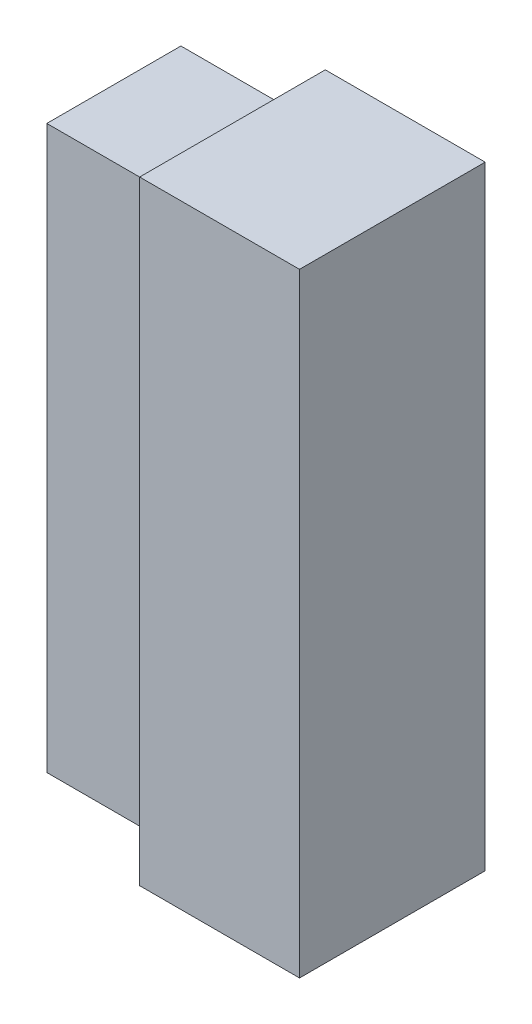
ISO-10303-21;
HEADER;
FILE_DESCRIPTION(('STEP AP214'),'2;1');
FILE_NAME('part.step','',(''),(''),'','','');
FILE_SCHEMA(('AUTOMOTIVE_DESIGN { 1 0 10303 214 1 1 1 1 }'));
ENDSEC;
DATA;
#1=APPLICATION_CONTEXT('core data for automotive mechanical design processes');
#2=APPLICATION_PROTOCOL_DEFINITION('international standard','automotive_design',2000,#1);
#3=PRODUCT_CONTEXT('',#1,'mechanical');
#4=PRODUCT('Part','Part','',(#3));
#5=PRODUCT_RELATED_PRODUCT_CATEGORY('part','',(#4));
#6=PRODUCT_DEFINITION_FORMATION('','',#4);
#7=PRODUCT_DEFINITION_CONTEXT('part definition',#1,'design');
#8=PRODUCT_DEFINITION('design','',#6,#7);
#9=PRODUCT_DEFINITION_SHAPE('','',#8);
#10=(LENGTH_UNIT() NAMED_UNIT(*) SI_UNIT(.MILLI.,.METRE.));
#11=(NAMED_UNIT(*) PLANE_ANGLE_UNIT() SI_UNIT($,.RADIAN.));
#12=(NAMED_UNIT(*) SI_UNIT($,.STERADIAN.) SOLID_ANGLE_UNIT());
#13=UNCERTAINTY_MEASURE_WITH_UNIT(LENGTH_MEASURE(1.E-05),#10,'distance_accuracy_value','');
#14=(GEOMETRIC_REPRESENTATION_CONTEXT(3) GLOBAL_UNCERTAINTY_ASSIGNED_CONTEXT((#13)) GLOBAL_UNIT_ASSIGNED_CONTEXT((#10,
#11,#12)) REPRESENTATION_CONTEXT('',''));
#15=CARTESIAN_POINT('',(0.,0.,0.));
#16=DIRECTION('',(0.,0.,1.));
#17=DIRECTION('',(1.,0.,0.));
#18=AXIS2_PLACEMENT_3D('',#15,#16,#17);
#19=CARTESIAN_POINT('',(0.,119.,0.));
#20=DIRECTION('',(1.,0.,0.));
#21=DIRECTION('',(0.,0.,-1.));
#22=AXIS2_PLACEMENT_3D('',#19,#20,#21);
#23=PLANE('',#22);
#24=DIRECTION('',(0.,0.,1.));
#25=VECTOR('',#24,1.);
#26=CARTESIAN_POINT('',(0.,0.,0.));
#27=LINE('',#26,#25);
#28=CARTESIAN_POINT('',(0.,0.,0.));
#29=VERTEX_POINT('',#28);
#30=CARTESIAN_POINT('',(0.,0.,36.));
#31=VERTEX_POINT('',#30);
#32=EDGE_CURVE('E118',#29,#31,#27,.T.);
#33=ORIENTED_EDGE('',*,*,#32,.T.);
#34=DIRECTION('',(0.,-1.,0.));
#35=VECTOR('',#34,1.);
#36=CARTESIAN_POINT('',(0.,119.,36.));
#37=LINE('',#36,#35);
#38=CARTESIAN_POINT('',(0.,119.,36.));
#39=VERTEX_POINT('',#38);
#40=EDGE_CURVE('E11',#39,#31,#37,.T.);
#41=ORIENTED_EDGE('',*,*,#40,.F.);
#42=DIRECTION('',(0.,0.,1.));
#43=VECTOR('',#42,1.);
#44=CARTESIAN_POINT('',(0.,119.,0.));
#45=LINE('',#44,#43);
#46=CARTESIAN_POINT('',(0.,119.,0.));
#47=VERTEX_POINT('',#46);
#48=EDGE_CURVE('E127',#47,#39,#45,.T.);
#49=ORIENTED_EDGE('',*,*,#48,.F.);
#50=DIRECTION('',(0.,-1.,0.));
#51=VECTOR('',#50,1.);
#52=CARTESIAN_POINT('',(0.,119.,0.));
#53=LINE('',#52,#51);
#54=EDGE_CURVE('E136',#47,#29,#53,.T.);
#55=ORIENTED_EDGE('',*,*,#54,.T.);
#56=EDGE_LOOP('',(#33,#41,#49,#55));
#57=FACE_BOUND('',#56,.T.);
#58=DIRECTION('',(0.,-1.,0.));
#59=VECTOR('',#58,1.);
#60=CARTESIAN_POINT('',(0.,114.,5.));
#61=LINE('',#60,#59);
#62=CARTESIAN_POINT('',(0.,114.,5.));
#63=VERTEX_POINT('',#62);
#64=CARTESIAN_POINT('',(0.,5.,5.));
#65=VERTEX_POINT('',#64);
#66=EDGE_CURVE('E48',#63,#65,#61,.T.);
#67=ORIENTED_EDGE('',*,*,#66,.F.);
#68=DIRECTION('',(0.,0.,-1.));
#69=VECTOR('',#68,1.);
#70=CARTESIAN_POINT('',(0.,114.,31.));
#71=LINE('',#70,#69);
#72=CARTESIAN_POINT('',(0.,114.,31.));
#73=VERTEX_POINT('',#72);
#74=EDGE_CURVE('E52',#73,#63,#71,.T.);
#75=ORIENTED_EDGE('',*,*,#74,.F.);
#76=DIRECTION('',(0.,1.,0.));
#77=VECTOR('',#76,1.);
#78=CARTESIAN_POINT('',(0.,5.,31.));
#79=LINE('',#78,#77);
#80=CARTESIAN_POINT('',(0.,5.,31.));
#81=VERTEX_POINT('',#80);
#82=EDGE_CURVE('E265',#81,#73,#79,.T.);
#83=ORIENTED_EDGE('',*,*,#82,.F.);
#84=DIRECTION('',(0.,0.,1.));
#85=VECTOR('',#84,1.);
#86=CARTESIAN_POINT('',(0.,5.,5.));
#87=LINE('',#86,#85);
#88=EDGE_CURVE('E271',#65,#81,#87,.T.);
#89=ORIENTED_EDGE('',*,*,#88,.F.);
#90=EDGE_LOOP('',(#67,#75,#83,#89));
#91=FACE_BOUND('',#90,.T.);
#92=ADVANCED_FACE('F34',(#57,#91),#23,.F.);
#93=CARTESIAN_POINT('',(0.,119.,36.));
#94=DIRECTION('',(0.,0.,-1.));
#95=DIRECTION('',(-1.,0.,0.));
#96=AXIS2_PLACEMENT_3D('',#93,#94,#95);
#97=PLANE('',#96);
#98=DIRECTION('',(1.,0.,0.));
#99=VECTOR('',#98,1.);
#100=CARTESIAN_POINT('',(0.,0.,36.));
#101=LINE('',#100,#99);
#102=CARTESIAN_POINT('',(31.,0.,36.));
#103=VERTEX_POINT('',#102);
#104=EDGE_CURVE('E121',#31,#103,#101,.T.);
#105=ORIENTED_EDGE('',*,*,#104,.T.);
#106=DIRECTION('',(0.,-1.,0.));
#107=VECTOR('',#106,1.);
#108=CARTESIAN_POINT('',(31.,119.,36.));
#109=LINE('',#108,#107);
#110=CARTESIAN_POINT('',(31.,119.,36.));
#111=VERTEX_POINT('',#110);
#112=EDGE_CURVE('E41',#111,#103,#109,.T.);
#113=ORIENTED_EDGE('',*,*,#112,.F.);
#114=DIRECTION('',(1.,0.,0.));
#115=VECTOR('',#114,1.);
#116=CARTESIAN_POINT('',(0.,119.,36.));
#117=LINE('',#116,#115);
#118=EDGE_CURVE('E130',#39,#111,#117,.T.);
#119=ORIENTED_EDGE('',*,*,#118,.F.);
#120=ORIENTED_EDGE('',*,*,#40,.T.);
#121=EDGE_LOOP('',(#105,#113,#119,#120));
#122=FACE_BOUND('',#121,.T.);
#123=ADVANCED_FACE('F167',(#122),#97,.F.);
#124=CARTESIAN_POINT('',(31.,119.,0.));
#125=DIRECTION('',(-1.,0.,0.));
#126=DIRECTION('',(0.,0.,1.));
#127=AXIS2_PLACEMENT_3D('',#124,#125,#126);
#128=PLANE('',#127);
#129=DIRECTION('',(0.,0.,-1.));
#130=VECTOR('',#129,1.);
#131=CARTESIAN_POINT('',(31.,0.,0.));
#132=LINE('',#131,#130);
#133=CARTESIAN_POINT('',(31.,0.,0.));
#134=VERTEX_POINT('',#133);
#135=EDGE_CURVE('E139',#103,#134,#132,.T.);
#136=ORIENTED_EDGE('',*,*,#135,.T.);
#137=DIRECTION('',(0.,-1.,0.));
#138=VECTOR('',#137,1.);
#139=CARTESIAN_POINT('',(31.,119.,0.));
#140=LINE('',#139,#138);
#141=CARTESIAN_POINT('',(31.,119.,0.));
#142=VERTEX_POINT('',#141);
#143=EDGE_CURVE('E144',#142,#134,#140,.T.);
#144=ORIENTED_EDGE('',*,*,#143,.F.);
#145=DIRECTION('',(0.,0.,-1.));
#146=VECTOR('',#145,1.);
#147=CARTESIAN_POINT('',(31.,119.,0.));
#148=LINE('',#147,#146);
#149=EDGE_CURVE('E133',#111,#142,#148,.T.);
#150=ORIENTED_EDGE('',*,*,#149,.F.);
#151=ORIENTED_EDGE('',*,*,#112,.T.);
#152=EDGE_LOOP('',(#136,#144,#150,#151));
#153=FACE_BOUND('',#152,.T.);
#154=ADVANCED_FACE('F151',(#153),#128,.F.);
#155=CARTESIAN_POINT('',(0.,119.,0.));
#156=DIRECTION('',(0.,0.,1.));
#157=DIRECTION('',(1.,0.,0.));
#158=AXIS2_PLACEMENT_3D('',#155,#156,#157);
#159=PLANE('',#158);
#160=DIRECTION('',(-1.,0.,0.));
#161=VECTOR('',#160,1.);
#162=CARTESIAN_POINT('',(0.,0.,0.));
#163=LINE('',#162,#161);
#164=EDGE_CURVE('E131',#134,#29,#163,.T.);
#165=ORIENTED_EDGE('',*,*,#164,.T.);
#166=ORIENTED_EDGE('',*,*,#54,.F.);
#167=DIRECTION('',(-1.,0.,0.));
#168=VECTOR('',#167,1.);
#169=CARTESIAN_POINT('',(0.,119.,0.));
#170=LINE('',#169,#168);
#171=EDGE_CURVE('E135',#142,#47,#170,.T.);
#172=ORIENTED_EDGE('',*,*,#171,.F.);
#173=ORIENTED_EDGE('',*,*,#143,.T.);
#174=EDGE_LOOP('',(#165,#166,#172,#173));
#175=FACE_BOUND('',#174,.T.);
#176=ADVANCED_FACE('F160',(#175),#159,.F.);
#177=CARTESIAN_POINT('',(0.,119.,0.));
#178=DIRECTION('',(0.,1.,0.));
#179=DIRECTION('',(0.,0.,1.));
#180=AXIS2_PLACEMENT_3D('',#177,#178,#179);
#181=PLANE('',#180);
#182=ORIENTED_EDGE('',*,*,#48,.T.);
#183=ORIENTED_EDGE('',*,*,#118,.T.);
#184=ORIENTED_EDGE('',*,*,#149,.T.);
#185=ORIENTED_EDGE('',*,*,#171,.T.);
#186=EDGE_LOOP('',(#182,#183,#184,#185));
#187=FACE_BOUND('',#186,.T.);
#188=ADVANCED_FACE('F166',(#187),#181,.T.);
#189=CARTESIAN_POINT('',(0.,0.,0.));
#190=DIRECTION('',(0.,1.,0.));
#191=DIRECTION('',(0.,0.,1.));
#192=AXIS2_PLACEMENT_3D('',#189,#190,#191);
#193=PLANE('',#192);
#194=ORIENTED_EDGE('',*,*,#32,.F.);
#195=ORIENTED_EDGE('',*,*,#164,.F.);
#196=ORIENTED_EDGE('',*,*,#135,.F.);
#197=ORIENTED_EDGE('',*,*,#104,.F.);
#198=EDGE_LOOP('',(#194,#195,#196,#197));
#199=FACE_BOUND('',#198,.T.);
#200=ADVANCED_FACE('F157',(#199),#193,.F.);
#201=CARTESIAN_POINT('',(-23.,114.,5.));
#202=DIRECTION('',(0.,0.,1.));
#203=DIRECTION('',(1.,0.,0.));
#204=AXIS2_PLACEMENT_3D('',#201,#202,#203);
#205=PLANE('',#204);
#206=ORIENTED_EDGE('',*,*,#66,.T.);
#207=DIRECTION('',(1.,0.,0.));
#208=VECTOR('',#207,1.);
#209=CARTESIAN_POINT('',(-23.,5.,5.));
#210=LINE('',#209,#208);
#211=CARTESIAN_POINT('',(-23.,5.,5.));
#212=VERTEX_POINT('',#211);
#213=EDGE_CURVE('E101',#212,#65,#210,.T.);
#214=ORIENTED_EDGE('',*,*,#213,.F.);
#215=DIRECTION('',(0.,-1.,0.));
#216=VECTOR('',#215,1.);
#217=CARTESIAN_POINT('',(-23.,114.,5.));
#218=LINE('',#217,#216);
#219=CARTESIAN_POINT('',(-23.,114.,5.));
#220=VERTEX_POINT('',#219);
#221=EDGE_CURVE('E107',#220,#212,#218,.T.);
#222=ORIENTED_EDGE('',*,*,#221,.F.);
#223=DIRECTION('',(1.,0.,0.));
#224=VECTOR('',#223,1.);
#225=CARTESIAN_POINT('',(-23.,114.,5.));
#226=LINE('',#225,#224);
#227=EDGE_CURVE('E263',#220,#63,#226,.T.);
#228=ORIENTED_EDGE('',*,*,#227,.T.);
#229=EDGE_LOOP('',(#206,#214,#222,#228));
#230=FACE_BOUND('',#229,.T.);
#231=ADVANCED_FACE('F117',(#230),#205,.F.);
#232=CARTESIAN_POINT('',(-23.,5.,5.));
#233=DIRECTION('',(0.,1.,0.));
#234=DIRECTION('',(0.,0.,1.));
#235=AXIS2_PLACEMENT_3D('',#232,#233,#234);
#236=PLANE('',#235);
#237=ORIENTED_EDGE('',*,*,#88,.T.);
#238=DIRECTION('',(1.,0.,0.));
#239=VECTOR('',#238,1.);
#240=CARTESIAN_POINT('',(-23.,5.,31.));
#241=LINE('',#240,#239);
#242=CARTESIAN_POINT('',(-23.,5.,31.));
#243=VERTEX_POINT('',#242);
#244=EDGE_CURVE('E103',#243,#81,#241,.T.);
#245=ORIENTED_EDGE('',*,*,#244,.F.);
#246=DIRECTION('',(0.,0.,1.));
#247=VECTOR('',#246,1.);
#248=CARTESIAN_POINT('',(-23.,5.,5.));
#249=LINE('',#248,#247);
#250=EDGE_CURVE('E96',#212,#243,#249,.T.);
#251=ORIENTED_EDGE('',*,*,#250,.F.);
#252=ORIENTED_EDGE('',*,*,#213,.T.);
#253=EDGE_LOOP('',(#237,#245,#251,#252));
#254=FACE_BOUND('',#253,.T.);
#255=ADVANCED_FACE('F99',(#254),#236,.F.);
#256=CARTESIAN_POINT('',(-23.,5.,31.));
#257=DIRECTION('',(0.,0.,-1.));
#258=DIRECTION('',(-1.,0.,0.));
#259=AXIS2_PLACEMENT_3D('',#256,#257,#258);
#260=PLANE('',#259);
#261=ORIENTED_EDGE('',*,*,#82,.T.);
#262=DIRECTION('',(1.,0.,0.));
#263=VECTOR('',#262,1.);
#264=CARTESIAN_POINT('',(-23.,114.,31.));
#265=LINE('',#264,#263);
#266=CARTESIAN_POINT('',(-23.,114.,31.));
#267=VERTEX_POINT('',#266);
#268=EDGE_CURVE('E123',#267,#73,#265,.T.);
#269=ORIENTED_EDGE('',*,*,#268,.F.);
#270=DIRECTION('',(0.,1.,0.));
#271=VECTOR('',#270,1.);
#272=CARTESIAN_POINT('',(-23.,5.,31.));
#273=LINE('',#272,#271);
#274=EDGE_CURVE('E106',#243,#267,#273,.T.);
#275=ORIENTED_EDGE('',*,*,#274,.F.);
#276=ORIENTED_EDGE('',*,*,#244,.T.);
#277=EDGE_LOOP('',(#261,#269,#275,#276));
#278=FACE_BOUND('',#277,.T.);
#279=ADVANCED_FACE('F185',(#278),#260,.F.);
#280=CARTESIAN_POINT('',(-23.,114.,31.));
#281=DIRECTION('',(0.,-1.,0.));
#282=DIRECTION('',(0.,0.,-1.));
#283=AXIS2_PLACEMENT_3D('',#280,#281,#282);
#284=PLANE('',#283);
#285=ORIENTED_EDGE('',*,*,#74,.T.);
#286=ORIENTED_EDGE('',*,*,#227,.F.);
#287=DIRECTION('',(0.,0.,-1.));
#288=VECTOR('',#287,1.);
#289=CARTESIAN_POINT('',(-23.,114.,31.));
#290=LINE('',#289,#288);
#291=EDGE_CURVE('E112',#267,#220,#290,.T.);
#292=ORIENTED_EDGE('',*,*,#291,.F.);
#293=ORIENTED_EDGE('',*,*,#268,.T.);
#294=EDGE_LOOP('',(#285,#286,#292,#293));
#295=FACE_BOUND('',#294,.T.);
#296=ADVANCED_FACE('F188',(#295),#284,.F.);
#297=CARTESIAN_POINT('',(-23.,0.,0.));
#298=DIRECTION('',(-1.,0.,0.));
#299=DIRECTION('',(0.,0.,1.));
#300=AXIS2_PLACEMENT_3D('',#297,#298,#299);
#301=PLANE('',#300);
#302=ORIENTED_EDGE('',*,*,#221,.T.);
#303=ORIENTED_EDGE('',*,*,#250,.T.);
#304=ORIENTED_EDGE('',*,*,#274,.T.);
#305=ORIENTED_EDGE('',*,*,#291,.T.);
#306=EDGE_LOOP('',(#302,#303,#304,#305));
#307=FACE_BOUND('',#306,.T.);
#308=ADVANCED_FACE('F110',(#307),#301,.T.);
#309=CLOSED_SHELL('',(#92,#123,#154,#176,#188,#200,#231,#255,#279,#296,#308));
#310=MANIFOLD_SOLID_BREP('B2',#309);
#311=ADVANCED_BREP_SHAPE_REPRESENTATION('',(#18,#310),#14);
#312=SHAPE_DEFINITION_REPRESENTATION(#9,#311);
ENDSEC;
END-ISO-10303-21;
